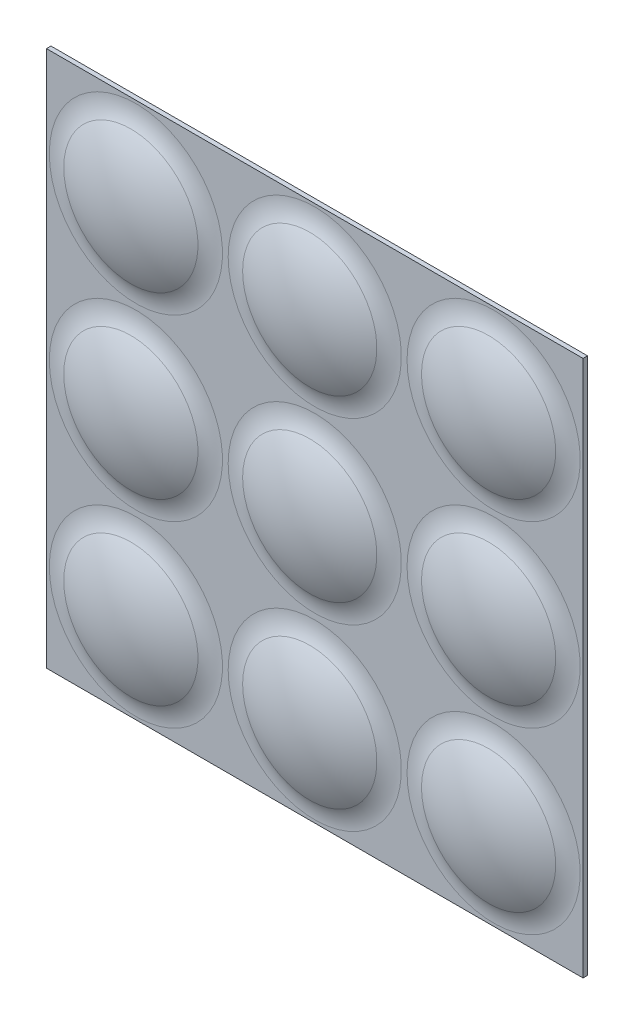
ISO-10303-21;
HEADER;
FILE_DESCRIPTION(('STEP AP214'),'2;1');
FILE_NAME('part.step','',(''),(''),'','','');
FILE_SCHEMA(('AUTOMOTIVE_DESIGN { 1 0 10303 214 1 1 1 1 }'));
ENDSEC;
DATA;
#1=APPLICATION_CONTEXT('core data for automotive mechanical design processes');
#2=APPLICATION_PROTOCOL_DEFINITION('international standard','automotive_design',2000,#1);
#3=PRODUCT_CONTEXT('',#1,'mechanical');
#4=PRODUCT('Part','Part','',(#3));
#5=PRODUCT_RELATED_PRODUCT_CATEGORY('part','',(#4));
#6=PRODUCT_DEFINITION_FORMATION('','',#4);
#7=PRODUCT_DEFINITION_CONTEXT('part definition',#1,'design');
#8=PRODUCT_DEFINITION('design','',#6,#7);
#9=PRODUCT_DEFINITION_SHAPE('','',#8);
#10=(LENGTH_UNIT() NAMED_UNIT(*) SI_UNIT(.MILLI.,.METRE.));
#11=(NAMED_UNIT(*) PLANE_ANGLE_UNIT() SI_UNIT($,.RADIAN.));
#12=(NAMED_UNIT(*) SI_UNIT($,.STERADIAN.) SOLID_ANGLE_UNIT());
#13=UNCERTAINTY_MEASURE_WITH_UNIT(LENGTH_MEASURE(1.E-05),#10,'distance_accuracy_value','');
#14=(GEOMETRIC_REPRESENTATION_CONTEXT(3) GLOBAL_UNCERTAINTY_ASSIGNED_CONTEXT((#13)) GLOBAL_UNIT_ASSIGNED_CONTEXT((#10,
#11,#12)) REPRESENTATION_CONTEXT('',''));
#15=CARTESIAN_POINT('',(0.,0.,0.));
#16=DIRECTION('',(0.,0.,1.));
#17=DIRECTION('',(1.,0.,0.));
#18=AXIS2_PLACEMENT_3D('',#15,#16,#17);
#19=CARTESIAN_POINT('',(-60.,-60.,1.));
#20=DIRECTION('',(1.,0.,0.));
#21=DIRECTION('',(0.,-1.,0.));
#22=AXIS2_PLACEMENT_3D('',#19,#20,#21);
#23=PLANE('',#22);
#24=DIRECTION('',(0.,0.,1.));
#25=VECTOR('',#24,1.);
#26=CARTESIAN_POINT('',(-60.,60.,1.));
#27=LINE('',#26,#25);
#28=CARTESIAN_POINT('',(-60.,60.,0.));
#29=VERTEX_POINT('',#28);
#30=CARTESIAN_POINT('',(-60.,60.,1.));
#31=VERTEX_POINT('',#30);
#32=EDGE_CURVE('E11',#29,#31,#27,.T.);
#33=ORIENTED_EDGE('',*,*,#32,.F.);
#34=DIRECTION('',(0.,1.,0.));
#35=VECTOR('',#34,1.);
#36=CARTESIAN_POINT('',(-60.,0.,0.));
#37=LINE('',#36,#35);
#38=CARTESIAN_POINT('',(-60.,-60.,0.));
#39=VERTEX_POINT('',#38);
#40=EDGE_CURVE('E91',#29,#39,#37,.F.);
#41=ORIENTED_EDGE('',*,*,#40,.T.);
#42=DIRECTION('',(0.,0.,1.));
#43=VECTOR('',#42,1.);
#44=CARTESIAN_POINT('',(-60.,-60.,1.));
#45=LINE('',#44,#43);
#46=CARTESIAN_POINT('',(-60.,-60.,1.));
#47=VERTEX_POINT('',#46);
#48=EDGE_CURVE('E47',#39,#47,#45,.T.);
#49=ORIENTED_EDGE('',*,*,#48,.T.);
#50=DIRECTION('',(0.,-1.,0.));
#51=VECTOR('',#50,1.);
#52=CARTESIAN_POINT('',(-60.,-60.,1.));
#53=LINE('',#52,#51);
#54=EDGE_CURVE('E108',#31,#47,#53,.T.);
#55=ORIENTED_EDGE('',*,*,#54,.F.);
#56=EDGE_LOOP('',(#33,#41,#49,#55));
#57=FACE_BOUND('',#56,.T.);
#58=ADVANCED_FACE('F37',(#57),#23,.F.);
#59=CARTESIAN_POINT('',(-60.,-60.,1.));
#60=DIRECTION('',(0.,1.,0.));
#61=DIRECTION('',(1.,0.,0.));
#62=AXIS2_PLACEMENT_3D('',#59,#60,#61);
#63=PLANE('',#62);
#64=ORIENTED_EDGE('',*,*,#48,.F.);
#65=DIRECTION('',(-1.,0.,0.));
#66=VECTOR('',#65,1.);
#67=CARTESIAN_POINT('',(0.,-60.,0.));
#68=LINE('',#67,#66);
#69=CARTESIAN_POINT('',(60.,-60.,0.));
#70=VERTEX_POINT('',#69);
#71=EDGE_CURVE('E102',#39,#70,#68,.F.);
#72=ORIENTED_EDGE('',*,*,#71,.T.);
#73=DIRECTION('',(0.,0.,1.));
#74=VECTOR('',#73,1.);
#75=CARTESIAN_POINT('',(60.,-60.,1.));
#76=LINE('',#75,#74);
#77=CARTESIAN_POINT('',(60.,-60.,1.));
#78=VERTEX_POINT('',#77);
#79=EDGE_CURVE('E55',#70,#78,#76,.T.);
#80=ORIENTED_EDGE('',*,*,#79,.T.);
#81=DIRECTION('',(1.,0.,0.));
#82=VECTOR('',#81,1.);
#83=CARTESIAN_POINT('',(-60.,-60.,1.));
#84=LINE('',#83,#82);
#85=EDGE_CURVE('E85',#47,#78,#84,.T.);
#86=ORIENTED_EDGE('',*,*,#85,.F.);
#87=EDGE_LOOP('',(#64,#72,#80,#86));
#88=FACE_BOUND('',#87,.T.);
#89=ADVANCED_FACE('F112',(#88),#63,.F.);
#90=CARTESIAN_POINT('',(60.,-60.,1.));
#91=DIRECTION('',(-1.,0.,0.));
#92=DIRECTION('',(0.,1.,0.));
#93=AXIS2_PLACEMENT_3D('',#90,#91,#92);
#94=PLANE('',#93);
#95=ORIENTED_EDGE('',*,*,#79,.F.);
#96=DIRECTION('',(0.,1.,0.));
#97=VECTOR('',#96,1.);
#98=CARTESIAN_POINT('',(60.,0.,0.));
#99=LINE('',#98,#97);
#100=CARTESIAN_POINT('',(60.,60.,0.));
#101=VERTEX_POINT('',#100);
#102=EDGE_CURVE('E90',#70,#101,#99,.T.);
#103=ORIENTED_EDGE('',*,*,#102,.T.);
#104=DIRECTION('',(0.,0.,1.));
#105=VECTOR('',#104,1.);
#106=CARTESIAN_POINT('',(60.,60.,1.));
#107=LINE('',#106,#105);
#108=CARTESIAN_POINT('',(60.,60.,1.));
#109=VERTEX_POINT('',#108);
#110=EDGE_CURVE('E41',#101,#109,#107,.T.);
#111=ORIENTED_EDGE('',*,*,#110,.T.);
#112=DIRECTION('',(0.,1.,0.));
#113=VECTOR('',#112,1.);
#114=CARTESIAN_POINT('',(60.,-60.,1.));
#115=LINE('',#114,#113);
#116=EDGE_CURVE('E104',#78,#109,#115,.T.);
#117=ORIENTED_EDGE('',*,*,#116,.F.);
#118=EDGE_LOOP('',(#95,#103,#111,#117));
#119=FACE_BOUND('',#118,.T.);
#120=ADVANCED_FACE('F93',(#119),#94,.F.);
#121=CARTESIAN_POINT('',(-60.,60.,1.));
#122=DIRECTION('',(0.,-1.,0.));
#123=DIRECTION('',(-1.,0.,0.));
#124=AXIS2_PLACEMENT_3D('',#121,#122,#123);
#125=PLANE('',#124);
#126=DIRECTION('',(-1.,0.,0.));
#127=VECTOR('',#126,1.);
#128=CARTESIAN_POINT('',(0.,60.,0.));
#129=LINE('',#128,#127);
#130=EDGE_CURVE('E79',#101,#29,#129,.T.);
#131=ORIENTED_EDGE('',*,*,#130,.T.);
#132=ORIENTED_EDGE('',*,*,#32,.T.);
#133=DIRECTION('',(-1.,0.,0.));
#134=VECTOR('',#133,1.);
#135=CARTESIAN_POINT('',(-60.,60.,1.));
#136=LINE('',#135,#134);
#137=EDGE_CURVE('E81',#109,#31,#136,.T.);
#138=ORIENTED_EDGE('',*,*,#137,.F.);
#139=ORIENTED_EDGE('',*,*,#110,.F.);
#140=EDGE_LOOP('',(#131,#132,#138,#139));
#141=FACE_BOUND('',#140,.T.);
#142=ADVANCED_FACE('F39',(#141),#125,.F.);
#143=CARTESIAN_POINT('',(0.,0.,1.));
#144=DIRECTION('',(0.,0.,-1.));
#145=DIRECTION('',(-1.,0.,0.));
#146=AXIS2_PLACEMENT_3D('',#143,#144,#145);
#147=PLANE('',#146);
#148=CARTESIAN_POINT('',(-40.,-40.,0.999999999999997));
#149=DIRECTION('',(0.,0.,-1.));
#150=DIRECTION('',(-1.,0.,0.));
#151=AXIS2_PLACEMENT_3D('',#148,#149,#150);
#152=CIRCLE('',#151,19.3649167310371);
#153=CARTESIAN_POINT('',(-59.3649167310371,-40.,0.999999999999997));
#154=VERTEX_POINT('',#153);
#155=EDGE_CURVE('E277',#154,#154,#152,.F.);
#156=ORIENTED_EDGE('',*,*,#155,.F.);
#157=EDGE_LOOP('',(#156));
#158=FACE_BOUND('',#157,.T.);
#159=CARTESIAN_POINT('',(0.,-40.,0.999999999999997));
#160=DIRECTION('',(0.,0.,-1.));
#161=DIRECTION('',(-1.,0.,0.));
#162=AXIS2_PLACEMENT_3D('',#159,#160,#161);
#163=CIRCLE('',#162,19.3649167310371);
#164=CARTESIAN_POINT('',(-19.3649167310371,-40.,0.999999999999997));
#165=VERTEX_POINT('',#164);
#166=EDGE_CURVE('E292',#165,#165,#163,.F.);
#167=ORIENTED_EDGE('',*,*,#166,.F.);
#168=EDGE_LOOP('',(#167));
#169=FACE_BOUND('',#168,.T.);
#170=CARTESIAN_POINT('',(40.,-40.,0.999999999999997));
#171=DIRECTION('',(0.,0.,-1.));
#172=DIRECTION('',(-1.,0.,0.));
#173=AXIS2_PLACEMENT_3D('',#170,#171,#172);
#174=CIRCLE('',#173,19.3649167310371);
#175=CARTESIAN_POINT('',(20.6350832689629,-40.,0.999999999999997));
#176=VERTEX_POINT('',#175);
#177=EDGE_CURVE('E304',#176,#176,#174,.F.);
#178=ORIENTED_EDGE('',*,*,#177,.F.);
#179=EDGE_LOOP('',(#178));
#180=FACE_BOUND('',#179,.T.);
#181=CARTESIAN_POINT('',(-40.,0.,0.999999999999997));
#182=DIRECTION('',(0.,0.,-1.));
#183=DIRECTION('',(-1.,0.,0.));
#184=AXIS2_PLACEMENT_3D('',#181,#182,#183);
#185=CIRCLE('',#184,19.3649167310371);
#186=CARTESIAN_POINT('',(-59.3649167310371,0.,0.999999999999997));
#187=VERTEX_POINT('',#186);
#188=EDGE_CURVE('E316',#187,#187,#185,.F.);
#189=ORIENTED_EDGE('',*,*,#188,.F.);
#190=EDGE_LOOP('',(#189));
#191=FACE_BOUND('',#190,.T.);
#192=CARTESIAN_POINT('',(0.,0.,0.999999999999997));
#193=DIRECTION('',(0.,0.,-1.));
#194=DIRECTION('',(-1.,0.,0.));
#195=AXIS2_PLACEMENT_3D('',#192,#193,#194);
#196=CIRCLE('',#195,19.3649167310371);
#197=CARTESIAN_POINT('',(-19.3649167310371,0.,0.999999999999997));
#198=VERTEX_POINT('',#197);
#199=EDGE_CURVE('E328',#198,#198,#196,.F.);
#200=ORIENTED_EDGE('',*,*,#199,.F.);
#201=EDGE_LOOP('',(#200));
#202=FACE_BOUND('',#201,.T.);
#203=CARTESIAN_POINT('',(40.,0.,0.999999999999997));
#204=DIRECTION('',(0.,0.,-1.));
#205=DIRECTION('',(-1.,0.,0.));
#206=AXIS2_PLACEMENT_3D('',#203,#204,#205);
#207=CIRCLE('',#206,19.3649167310371);
#208=CARTESIAN_POINT('',(20.6350832689629,0.,0.999999999999997));
#209=VERTEX_POINT('',#208);
#210=EDGE_CURVE('E340',#209,#209,#207,.F.);
#211=ORIENTED_EDGE('',*,*,#210,.F.);
#212=EDGE_LOOP('',(#211));
#213=FACE_BOUND('',#212,.T.);
#214=CARTESIAN_POINT('',(-40.,40.,0.999999999999997));
#215=DIRECTION('',(0.,0.,-1.));
#216=DIRECTION('',(-1.,0.,0.));
#217=AXIS2_PLACEMENT_3D('',#214,#215,#216);
#218=CIRCLE('',#217,19.3649167310371);
#219=CARTESIAN_POINT('',(-59.3649167310371,40.,0.999999999999997));
#220=VERTEX_POINT('',#219);
#221=EDGE_CURVE('E352',#220,#220,#218,.F.);
#222=ORIENTED_EDGE('',*,*,#221,.F.);
#223=EDGE_LOOP('',(#222));
#224=FACE_BOUND('',#223,.T.);
#225=CARTESIAN_POINT('',(0.,40.,0.999999999999997));
#226=DIRECTION('',(0.,0.,-1.));
#227=DIRECTION('',(-1.,0.,0.));
#228=AXIS2_PLACEMENT_3D('',#225,#226,#227);
#229=CIRCLE('',#228,19.3649167310371);
#230=CARTESIAN_POINT('',(-19.3649167310371,40.,0.999999999999997));
#231=VERTEX_POINT('',#230);
#232=EDGE_CURVE('E364',#231,#231,#229,.F.);
#233=ORIENTED_EDGE('',*,*,#232,.F.);
#234=EDGE_LOOP('',(#233));
#235=FACE_BOUND('',#234,.T.);
#236=CARTESIAN_POINT('',(40.,40.,0.999999999999997));
#237=DIRECTION('',(0.,0.,-1.));
#238=DIRECTION('',(-1.,0.,0.));
#239=AXIS2_PLACEMENT_3D('',#236,#237,#238);
#240=CIRCLE('',#239,19.3649167310371);
#241=CARTESIAN_POINT('',(20.6350832689629,40.,0.999999999999997));
#242=VERTEX_POINT('',#241);
#243=EDGE_CURVE('E374',#242,#242,#240,.F.);
#244=ORIENTED_EDGE('',*,*,#243,.F.);
#245=EDGE_LOOP('',(#244));
#246=FACE_BOUND('',#245,.T.);
#247=ORIENTED_EDGE('',*,*,#116,.T.);
#248=ORIENTED_EDGE('',*,*,#137,.T.);
#249=ORIENTED_EDGE('',*,*,#54,.T.);
#250=ORIENTED_EDGE('',*,*,#85,.T.);
#251=EDGE_LOOP('',(#247,#248,#249,#250));
#252=FACE_BOUND('',#251,.T.);
#253=ADVANCED_FACE('F111',(#158,#169,#180,#191,#202,#213,#224,#235,#246,#252),#147,.F.);
#254=CARTESIAN_POINT('',(0.,0.,0.));
#255=DIRECTION('',(0.,0.,-1.));
#256=DIRECTION('',(-1.,0.,0.));
#257=AXIS2_PLACEMENT_3D('',#254,#255,#256);
#258=PLANE('',#257);
#259=CARTESIAN_POINT('',(-40.,-40.,0.));
#260=DIRECTION('',(0.,0.,-1.));
#261=DIRECTION('',(0.,1.,0.));
#262=AXIS2_PLACEMENT_3D('',#259,#260,#261);
#263=CIRCLE('',#262,19.3649167310371);
#264=CARTESIAN_POINT('',(-40.,-20.6350832689629,0.));
#265=VERTEX_POINT('',#264);
#266=EDGE_CURVE('E276',#265,#265,#263,.F.);
#267=ORIENTED_EDGE('',*,*,#266,.T.);
#268=EDGE_LOOP('',(#267));
#269=FACE_BOUND('',#268,.T.);
#270=CARTESIAN_POINT('',(0.,-40.,0.));
#271=DIRECTION('',(0.,0.,-1.));
#272=DIRECTION('',(0.,1.,0.));
#273=AXIS2_PLACEMENT_3D('',#270,#271,#272);
#274=CIRCLE('',#273,19.3649167310371);
#275=CARTESIAN_POINT('',(0.,-20.6350832689629,0.));
#276=VERTEX_POINT('',#275);
#277=EDGE_CURVE('E291',#276,#276,#274,.F.);
#278=ORIENTED_EDGE('',*,*,#277,.T.);
#279=EDGE_LOOP('',(#278));
#280=FACE_BOUND('',#279,.T.);
#281=CARTESIAN_POINT('',(40.,-40.,0.));
#282=DIRECTION('',(0.,0.,-1.));
#283=DIRECTION('',(0.,1.,0.));
#284=AXIS2_PLACEMENT_3D('',#281,#282,#283);
#285=CIRCLE('',#284,19.3649167310371);
#286=CARTESIAN_POINT('',(40.,-20.6350832689629,0.));
#287=VERTEX_POINT('',#286);
#288=EDGE_CURVE('E303',#287,#287,#285,.F.);
#289=ORIENTED_EDGE('',*,*,#288,.T.);
#290=EDGE_LOOP('',(#289));
#291=FACE_BOUND('',#290,.T.);
#292=CARTESIAN_POINT('',(-40.,0.,0.));
#293=DIRECTION('',(0.,0.,-1.));
#294=DIRECTION('',(0.,1.,0.));
#295=AXIS2_PLACEMENT_3D('',#292,#293,#294);
#296=CIRCLE('',#295,19.3649167310371);
#297=CARTESIAN_POINT('',(-40.,19.3649167310371,0.));
#298=VERTEX_POINT('',#297);
#299=EDGE_CURVE('E315',#298,#298,#296,.F.);
#300=ORIENTED_EDGE('',*,*,#299,.T.);
#301=EDGE_LOOP('',(#300));
#302=FACE_BOUND('',#301,.T.);
#303=CARTESIAN_POINT('',(0.,0.,0.));
#304=DIRECTION('',(0.,0.,-1.));
#305=DIRECTION('',(0.,1.,0.));
#306=AXIS2_PLACEMENT_3D('',#303,#304,#305);
#307=CIRCLE('',#306,19.3649167310371);
#308=CARTESIAN_POINT('',(0.,19.3649167310371,0.));
#309=VERTEX_POINT('',#308);
#310=EDGE_CURVE('E327',#309,#309,#307,.F.);
#311=ORIENTED_EDGE('',*,*,#310,.T.);
#312=EDGE_LOOP('',(#311));
#313=FACE_BOUND('',#312,.T.);
#314=CARTESIAN_POINT('',(40.,0.,0.));
#315=DIRECTION('',(0.,0.,-1.));
#316=DIRECTION('',(0.,1.,0.));
#317=AXIS2_PLACEMENT_3D('',#314,#315,#316);
#318=CIRCLE('',#317,19.3649167310371);
#319=CARTESIAN_POINT('',(40.,19.3649167310371,0.));
#320=VERTEX_POINT('',#319);
#321=EDGE_CURVE('E339',#320,#320,#318,.F.);
#322=ORIENTED_EDGE('',*,*,#321,.T.);
#323=EDGE_LOOP('',(#322));
#324=FACE_BOUND('',#323,.T.);
#325=CARTESIAN_POINT('',(-40.,40.,0.));
#326=DIRECTION('',(0.,0.,-1.));
#327=DIRECTION('',(0.,1.,0.));
#328=AXIS2_PLACEMENT_3D('',#325,#326,#327);
#329=CIRCLE('',#328,19.3649167310371);
#330=CARTESIAN_POINT('',(-40.,59.3649167310371,0.));
#331=VERTEX_POINT('',#330);
#332=EDGE_CURVE('E351',#331,#331,#329,.F.);
#333=ORIENTED_EDGE('',*,*,#332,.T.);
#334=EDGE_LOOP('',(#333));
#335=FACE_BOUND('',#334,.T.);
#336=CARTESIAN_POINT('',(0.,40.,0.));
#337=DIRECTION('',(0.,0.,-1.));
#338=DIRECTION('',(0.,1.,0.));
#339=AXIS2_PLACEMENT_3D('',#336,#337,#338);
#340=CIRCLE('',#339,19.3649167310371);
#341=CARTESIAN_POINT('',(0.,59.3649167310371,0.));
#342=VERTEX_POINT('',#341);
#343=EDGE_CURVE('E363',#342,#342,#340,.F.);
#344=ORIENTED_EDGE('',*,*,#343,.T.);
#345=EDGE_LOOP('',(#344));
#346=FACE_BOUND('',#345,.T.);
#347=CARTESIAN_POINT('',(40.,40.,0.));
#348=DIRECTION('',(0.,0.,-1.));
#349=DIRECTION('',(0.,1.,0.));
#350=AXIS2_PLACEMENT_3D('',#347,#348,#349);
#351=CIRCLE('',#350,19.3649167310371);
#352=CARTESIAN_POINT('',(40.,59.3649167310371,0.));
#353=VERTEX_POINT('',#352);
#354=EDGE_CURVE('E94',#353,#353,#351,.F.);
#355=ORIENTED_EDGE('',*,*,#354,.T.);
#356=EDGE_LOOP('',(#355));
#357=FACE_BOUND('',#356,.T.);
#358=ORIENTED_EDGE('',*,*,#102,.F.);
#359=ORIENTED_EDGE('',*,*,#71,.F.);
#360=ORIENTED_EDGE('',*,*,#40,.F.);
#361=ORIENTED_EDGE('',*,*,#130,.F.);
#362=EDGE_LOOP('',(#358,#359,#360,#361));
#363=FACE_BOUND('',#362,.T.);
#364=ADVANCED_FACE('F88',(#269,#280,#291,#302,#313,#324,#335,#346,#357,#363),#258,.T.);
#365=CARTESIAN_POINT('',(40.,40.,10.));
#366=DIRECTION('',(0.,0.,-1.));
#367=DIRECTION('',(0.,1.,0.));
#368=AXIS2_PLACEMENT_3D('',#365,#366,#367);
#369=TOROIDAL_SURFACE('',#368,19.3649167310371,10.);
#370=ORIENTED_EDGE('',*,*,#354,.F.);
#371=EDGE_LOOP('',(#370));
#372=FACE_BOUND('',#371,.T.);
#373=CARTESIAN_POINT('',(40.,40.,1.25));
#374=DIRECTION('',(0.,0.,-1.));
#375=DIRECTION('',(0.,1.,0.));
#376=AXIS2_PLACEMENT_3D('',#373,#374,#375);
#377=CIRCLE('',#376,14.5236875482778);
#378=CARTESIAN_POINT('',(40.,54.5236875482778,1.25));
#379=VERTEX_POINT('',#378);
#380=EDGE_CURVE('E97',#379,#379,#377,.F.);
#381=ORIENTED_EDGE('',*,*,#380,.T.);
#382=EDGE_LOOP('',(#381));
#383=FACE_BOUND('',#382,.T.);
#384=ADVANCED_FACE('F123',(#372,#383),#369,.T.);
#385=CARTESIAN_POINT('',(40.,40.,-25.));
#386=DIRECTION('',(0.,0.,-1.));
#387=DIRECTION('',(-1.,0.,0.));
#388=AXIS2_PLACEMENT_3D('',#385,#386,#387);
#389=SPHERICAL_SURFACE('',#388,31.);
#390=CARTESIAN_POINT('',(40.,40.,2.125));
#391=DIRECTION('',(0.,0.,-1.));
#392=DIRECTION('',(-1.,0.,0.));
#393=AXIS2_PLACEMENT_3D('',#390,#391,#392);
#394=CIRCLE('',#393,15.0078104665537);
#395=CARTESIAN_POINT('',(24.9921895334463,40.,2.125));
#396=VERTEX_POINT('',#395);
#397=EDGE_CURVE('E371',#396,#396,#394,.F.);
#398=ORIENTED_EDGE('',*,*,#397,.T.);
#399=EDGE_LOOP('',(#398));
#400=FACE_BOUND('',#399,.T.);
#401=ADVANCED_FACE('F130',(#400),#389,.T.);
#402=CARTESIAN_POINT('',(40.,40.,10.));
#403=DIRECTION('',(0.,0.,-1.));
#404=DIRECTION('',(0.,1.,0.));
#405=AXIS2_PLACEMENT_3D('',#402,#403,#404);
#406=TOROIDAL_SURFACE('',#405,19.3649167310371,9.);
#407=ORIENTED_EDGE('',*,*,#243,.T.);
#408=EDGE_LOOP('',(#407));
#409=FACE_BOUND('',#408,.T.);
#410=ORIENTED_EDGE('',*,*,#397,.F.);
#411=EDGE_LOOP('',(#410));
#412=FACE_BOUND('',#411,.T.);
#413=ADVANCED_FACE('F134',(#409,#412),#406,.F.);
#414=CARTESIAN_POINT('',(40.,40.,-25.));
#415=DIRECTION('',(0.,0.,-1.));
#416=DIRECTION('',(-1.,0.,0.));
#417=AXIS2_PLACEMENT_3D('',#414,#415,#416);
#418=SPHERICAL_SURFACE('',#417,30.);
#419=ORIENTED_EDGE('',*,*,#380,.F.);
#420=EDGE_LOOP('',(#419));
#421=FACE_BOUND('',#420,.T.);
#422=ADVANCED_FACE('F138',(#421),#418,.F.);
#423=CARTESIAN_POINT('',(0.,40.,10.));
#424=DIRECTION('',(0.,0.,-1.));
#425=DIRECTION('',(0.,1.,0.));
#426=AXIS2_PLACEMENT_3D('',#423,#424,#425);
#427=TOROIDAL_SURFACE('',#426,19.3649167310371,10.);
#428=ORIENTED_EDGE('',*,*,#343,.F.);
#429=EDGE_LOOP('',(#428));
#430=FACE_BOUND('',#429,.T.);
#431=CARTESIAN_POINT('',(0.,40.,1.25));
#432=DIRECTION('',(0.,0.,-1.));
#433=DIRECTION('',(0.,1.,0.));
#434=AXIS2_PLACEMENT_3D('',#431,#432,#433);
#435=CIRCLE('',#434,14.5236875482778);
#436=CARTESIAN_POINT('',(0.,54.5236875482778,1.25));
#437=VERTEX_POINT('',#436);
#438=EDGE_CURVE('E360',#437,#437,#435,.F.);
#439=ORIENTED_EDGE('',*,*,#438,.T.);
#440=EDGE_LOOP('',(#439));
#441=FACE_BOUND('',#440,.T.);
#442=ADVANCED_FACE('F142',(#430,#441),#427,.T.);
#443=CARTESIAN_POINT('',(0.,40.,-25.));
#444=DIRECTION('',(0.,0.,-1.));
#445=DIRECTION('',(-1.,0.,0.));
#446=AXIS2_PLACEMENT_3D('',#443,#444,#445);
#447=SPHERICAL_SURFACE('',#446,31.);
#448=CARTESIAN_POINT('',(0.,40.,2.125));
#449=DIRECTION('',(0.,0.,-1.));
#450=DIRECTION('',(-1.,0.,0.));
#451=AXIS2_PLACEMENT_3D('',#448,#449,#450);
#452=CIRCLE('',#451,15.0078104665537);
#453=CARTESIAN_POINT('',(-15.0078104665537,40.,2.125));
#454=VERTEX_POINT('',#453);
#455=EDGE_CURVE('E359',#454,#454,#452,.F.);
#456=ORIENTED_EDGE('',*,*,#455,.T.);
#457=EDGE_LOOP('',(#456));
#458=FACE_BOUND('',#457,.T.);
#459=ADVANCED_FACE('F146',(#458),#447,.T.);
#460=CARTESIAN_POINT('',(0.,40.,10.));
#461=DIRECTION('',(0.,0.,-1.));
#462=DIRECTION('',(0.,1.,0.));
#463=AXIS2_PLACEMENT_3D('',#460,#461,#462);
#464=TOROIDAL_SURFACE('',#463,19.3649167310371,9.);
#465=ORIENTED_EDGE('',*,*,#232,.T.);
#466=EDGE_LOOP('',(#465));
#467=FACE_BOUND('',#466,.T.);
#468=ORIENTED_EDGE('',*,*,#455,.F.);
#469=EDGE_LOOP('',(#468));
#470=FACE_BOUND('',#469,.T.);
#471=ADVANCED_FACE('F150',(#467,#470),#464,.F.);
#472=CARTESIAN_POINT('',(0.,40.,-25.));
#473=DIRECTION('',(0.,0.,-1.));
#474=DIRECTION('',(-1.,0.,0.));
#475=AXIS2_PLACEMENT_3D('',#472,#473,#474);
#476=SPHERICAL_SURFACE('',#475,30.);
#477=ORIENTED_EDGE('',*,*,#438,.F.);
#478=EDGE_LOOP('',(#477));
#479=FACE_BOUND('',#478,.T.);
#480=ADVANCED_FACE('F154',(#479),#476,.F.);
#481=CARTESIAN_POINT('',(-40.,40.,10.));
#482=DIRECTION('',(0.,0.,-1.));
#483=DIRECTION('',(0.,1.,0.));
#484=AXIS2_PLACEMENT_3D('',#481,#482,#483);
#485=TOROIDAL_SURFACE('',#484,19.3649167310371,10.);
#486=ORIENTED_EDGE('',*,*,#332,.F.);
#487=EDGE_LOOP('',(#486));
#488=FACE_BOUND('',#487,.T.);
#489=CARTESIAN_POINT('',(-40.,40.,1.25));
#490=DIRECTION('',(0.,0.,-1.));
#491=DIRECTION('',(0.,1.,0.));
#492=AXIS2_PLACEMENT_3D('',#489,#490,#491);
#493=CIRCLE('',#492,14.5236875482778);
#494=CARTESIAN_POINT('',(-40.,54.5236875482778,1.25));
#495=VERTEX_POINT('',#494);
#496=EDGE_CURVE('E348',#495,#495,#493,.F.);
#497=ORIENTED_EDGE('',*,*,#496,.T.);
#498=EDGE_LOOP('',(#497));
#499=FACE_BOUND('',#498,.T.);
#500=ADVANCED_FACE('F158',(#488,#499),#485,.T.);
#501=CARTESIAN_POINT('',(-40.,40.,-25.));
#502=DIRECTION('',(0.,0.,-1.));
#503=DIRECTION('',(-1.,0.,0.));
#504=AXIS2_PLACEMENT_3D('',#501,#502,#503);
#505=SPHERICAL_SURFACE('',#504,31.);
#506=CARTESIAN_POINT('',(-40.,40.,2.125));
#507=DIRECTION('',(0.,0.,-1.));
#508=DIRECTION('',(-1.,0.,0.));
#509=AXIS2_PLACEMENT_3D('',#506,#507,#508);
#510=CIRCLE('',#509,15.0078104665537);
#511=CARTESIAN_POINT('',(-55.0078104665537,40.,2.125));
#512=VERTEX_POINT('',#511);
#513=EDGE_CURVE('E347',#512,#512,#510,.F.);
#514=ORIENTED_EDGE('',*,*,#513,.T.);
#515=EDGE_LOOP('',(#514));
#516=FACE_BOUND('',#515,.T.);
#517=ADVANCED_FACE('F162',(#516),#505,.T.);
#518=CARTESIAN_POINT('',(-40.,40.,10.));
#519=DIRECTION('',(0.,0.,-1.));
#520=DIRECTION('',(0.,1.,0.));
#521=AXIS2_PLACEMENT_3D('',#518,#519,#520);
#522=TOROIDAL_SURFACE('',#521,19.3649167310371,9.);
#523=ORIENTED_EDGE('',*,*,#221,.T.);
#524=EDGE_LOOP('',(#523));
#525=FACE_BOUND('',#524,.T.);
#526=ORIENTED_EDGE('',*,*,#513,.F.);
#527=EDGE_LOOP('',(#526));
#528=FACE_BOUND('',#527,.T.);
#529=ADVANCED_FACE('F166',(#525,#528),#522,.F.);
#530=CARTESIAN_POINT('',(-40.,40.,-25.));
#531=DIRECTION('',(0.,0.,-1.));
#532=DIRECTION('',(-1.,0.,0.));
#533=AXIS2_PLACEMENT_3D('',#530,#531,#532);
#534=SPHERICAL_SURFACE('',#533,30.);
#535=ORIENTED_EDGE('',*,*,#496,.F.);
#536=EDGE_LOOP('',(#535));
#537=FACE_BOUND('',#536,.T.);
#538=ADVANCED_FACE('F170',(#537),#534,.F.);
#539=CARTESIAN_POINT('',(40.,0.,10.));
#540=DIRECTION('',(0.,0.,-1.));
#541=DIRECTION('',(0.,1.,0.));
#542=AXIS2_PLACEMENT_3D('',#539,#540,#541);
#543=TOROIDAL_SURFACE('',#542,19.3649167310371,10.);
#544=ORIENTED_EDGE('',*,*,#321,.F.);
#545=EDGE_LOOP('',(#544));
#546=FACE_BOUND('',#545,.T.);
#547=CARTESIAN_POINT('',(40.,0.,1.25));
#548=DIRECTION('',(0.,0.,-1.));
#549=DIRECTION('',(0.,1.,0.));
#550=AXIS2_PLACEMENT_3D('',#547,#548,#549);
#551=CIRCLE('',#550,14.5236875482778);
#552=CARTESIAN_POINT('',(40.,14.5236875482778,1.25));
#553=VERTEX_POINT('',#552);
#554=EDGE_CURVE('E336',#553,#553,#551,.F.);
#555=ORIENTED_EDGE('',*,*,#554,.T.);
#556=EDGE_LOOP('',(#555));
#557=FACE_BOUND('',#556,.T.);
#558=ADVANCED_FACE('F174',(#546,#557),#543,.T.);
#559=CARTESIAN_POINT('',(40.,0.,-25.));
#560=DIRECTION('',(0.,0.,-1.));
#561=DIRECTION('',(-1.,0.,0.));
#562=AXIS2_PLACEMENT_3D('',#559,#560,#561);
#563=SPHERICAL_SURFACE('',#562,31.);
#564=CARTESIAN_POINT('',(40.,0.,2.125));
#565=DIRECTION('',(0.,0.,-1.));
#566=DIRECTION('',(-1.,0.,0.));
#567=AXIS2_PLACEMENT_3D('',#564,#565,#566);
#568=CIRCLE('',#567,15.0078104665537);
#569=CARTESIAN_POINT('',(24.9921895334463,0.,2.125));
#570=VERTEX_POINT('',#569);
#571=EDGE_CURVE('E335',#570,#570,#568,.F.);
#572=ORIENTED_EDGE('',*,*,#571,.T.);
#573=EDGE_LOOP('',(#572));
#574=FACE_BOUND('',#573,.T.);
#575=ADVANCED_FACE('F178',(#574),#563,.T.);
#576=CARTESIAN_POINT('',(40.,0.,10.));
#577=DIRECTION('',(0.,0.,-1.));
#578=DIRECTION('',(0.,1.,0.));
#579=AXIS2_PLACEMENT_3D('',#576,#577,#578);
#580=TOROIDAL_SURFACE('',#579,19.3649167310371,9.);
#581=ORIENTED_EDGE('',*,*,#210,.T.);
#582=EDGE_LOOP('',(#581));
#583=FACE_BOUND('',#582,.T.);
#584=ORIENTED_EDGE('',*,*,#571,.F.);
#585=EDGE_LOOP('',(#584));
#586=FACE_BOUND('',#585,.T.);
#587=ADVANCED_FACE('F182',(#583,#586),#580,.F.);
#588=CARTESIAN_POINT('',(40.,0.,-25.));
#589=DIRECTION('',(0.,0.,-1.));
#590=DIRECTION('',(-1.,0.,0.));
#591=AXIS2_PLACEMENT_3D('',#588,#589,#590);
#592=SPHERICAL_SURFACE('',#591,30.);
#593=ORIENTED_EDGE('',*,*,#554,.F.);
#594=EDGE_LOOP('',(#593));
#595=FACE_BOUND('',#594,.T.);
#596=ADVANCED_FACE('F186',(#595),#592,.F.);
#597=CARTESIAN_POINT('',(0.,0.,10.));
#598=DIRECTION('',(0.,0.,-1.));
#599=DIRECTION('',(0.,1.,0.));
#600=AXIS2_PLACEMENT_3D('',#597,#598,#599);
#601=TOROIDAL_SURFACE('',#600,19.3649167310371,10.);
#602=ORIENTED_EDGE('',*,*,#310,.F.);
#603=EDGE_LOOP('',(#602));
#604=FACE_BOUND('',#603,.T.);
#605=CARTESIAN_POINT('',(0.,0.,1.25));
#606=DIRECTION('',(0.,0.,-1.));
#607=DIRECTION('',(0.,1.,0.));
#608=AXIS2_PLACEMENT_3D('',#605,#606,#607);
#609=CIRCLE('',#608,14.5236875482778);
#610=CARTESIAN_POINT('',(0.,14.5236875482778,1.25));
#611=VERTEX_POINT('',#610);
#612=EDGE_CURVE('E324',#611,#611,#609,.F.);
#613=ORIENTED_EDGE('',*,*,#612,.T.);
#614=EDGE_LOOP('',(#613));
#615=FACE_BOUND('',#614,.T.);
#616=ADVANCED_FACE('F190',(#604,#615),#601,.T.);
#617=CARTESIAN_POINT('',(0.,0.,-25.));
#618=DIRECTION('',(0.,0.,-1.));
#619=DIRECTION('',(-1.,0.,0.));
#620=AXIS2_PLACEMENT_3D('',#617,#618,#619);
#621=SPHERICAL_SURFACE('',#620,31.);
#622=CARTESIAN_POINT('',(0.,0.,2.125));
#623=DIRECTION('',(0.,0.,-1.));
#624=DIRECTION('',(-1.,0.,0.));
#625=AXIS2_PLACEMENT_3D('',#622,#623,#624);
#626=CIRCLE('',#625,15.0078104665537);
#627=CARTESIAN_POINT('',(-15.0078104665537,0.,2.125));
#628=VERTEX_POINT('',#627);
#629=EDGE_CURVE('E323',#628,#628,#626,.F.);
#630=ORIENTED_EDGE('',*,*,#629,.T.);
#631=EDGE_LOOP('',(#630));
#632=FACE_BOUND('',#631,.T.);
#633=ADVANCED_FACE('F194',(#632),#621,.T.);
#634=CARTESIAN_POINT('',(0.,0.,10.));
#635=DIRECTION('',(0.,0.,-1.));
#636=DIRECTION('',(0.,1.,0.));
#637=AXIS2_PLACEMENT_3D('',#634,#635,#636);
#638=TOROIDAL_SURFACE('',#637,19.3649167310371,9.);
#639=ORIENTED_EDGE('',*,*,#199,.T.);
#640=EDGE_LOOP('',(#639));
#641=FACE_BOUND('',#640,.T.);
#642=ORIENTED_EDGE('',*,*,#629,.F.);
#643=EDGE_LOOP('',(#642));
#644=FACE_BOUND('',#643,.T.);
#645=ADVANCED_FACE('F198',(#641,#644),#638,.F.);
#646=CARTESIAN_POINT('',(0.,0.,-25.));
#647=DIRECTION('',(0.,0.,-1.));
#648=DIRECTION('',(-1.,0.,0.));
#649=AXIS2_PLACEMENT_3D('',#646,#647,#648);
#650=SPHERICAL_SURFACE('',#649,30.);
#651=ORIENTED_EDGE('',*,*,#612,.F.);
#652=EDGE_LOOP('',(#651));
#653=FACE_BOUND('',#652,.T.);
#654=ADVANCED_FACE('F202',(#653),#650,.F.);
#655=CARTESIAN_POINT('',(-40.,0.,10.));
#656=DIRECTION('',(0.,0.,-1.));
#657=DIRECTION('',(0.,1.,0.));
#658=AXIS2_PLACEMENT_3D('',#655,#656,#657);
#659=TOROIDAL_SURFACE('',#658,19.3649167310371,10.);
#660=ORIENTED_EDGE('',*,*,#299,.F.);
#661=EDGE_LOOP('',(#660));
#662=FACE_BOUND('',#661,.T.);
#663=CARTESIAN_POINT('',(-40.,0.,1.25));
#664=DIRECTION('',(0.,0.,-1.));
#665=DIRECTION('',(0.,1.,0.));
#666=AXIS2_PLACEMENT_3D('',#663,#664,#665);
#667=CIRCLE('',#666,14.5236875482778);
#668=CARTESIAN_POINT('',(-40.,14.5236875482778,1.25));
#669=VERTEX_POINT('',#668);
#670=EDGE_CURVE('E312',#669,#669,#667,.F.);
#671=ORIENTED_EDGE('',*,*,#670,.T.);
#672=EDGE_LOOP('',(#671));
#673=FACE_BOUND('',#672,.T.);
#674=ADVANCED_FACE('F206',(#662,#673),#659,.T.);
#675=CARTESIAN_POINT('',(-40.,0.,-25.));
#676=DIRECTION('',(0.,0.,-1.));
#677=DIRECTION('',(-1.,0.,0.));
#678=AXIS2_PLACEMENT_3D('',#675,#676,#677);
#679=SPHERICAL_SURFACE('',#678,31.);
#680=CARTESIAN_POINT('',(-40.,0.,2.125));
#681=DIRECTION('',(0.,0.,-1.));
#682=DIRECTION('',(-1.,0.,0.));
#683=AXIS2_PLACEMENT_3D('',#680,#681,#682);
#684=CIRCLE('',#683,15.0078104665537);
#685=CARTESIAN_POINT('',(-55.0078104665537,0.,2.125));
#686=VERTEX_POINT('',#685);
#687=EDGE_CURVE('E311',#686,#686,#684,.F.);
#688=ORIENTED_EDGE('',*,*,#687,.T.);
#689=EDGE_LOOP('',(#688));
#690=FACE_BOUND('',#689,.T.);
#691=ADVANCED_FACE('F210',(#690),#679,.T.);
#692=CARTESIAN_POINT('',(-40.,0.,10.));
#693=DIRECTION('',(0.,0.,-1.));
#694=DIRECTION('',(0.,1.,0.));
#695=AXIS2_PLACEMENT_3D('',#692,#693,#694);
#696=TOROIDAL_SURFACE('',#695,19.3649167310371,9.);
#697=ORIENTED_EDGE('',*,*,#188,.T.);
#698=EDGE_LOOP('',(#697));
#699=FACE_BOUND('',#698,.T.);
#700=ORIENTED_EDGE('',*,*,#687,.F.);
#701=EDGE_LOOP('',(#700));
#702=FACE_BOUND('',#701,.T.);
#703=ADVANCED_FACE('F214',(#699,#702),#696,.F.);
#704=CARTESIAN_POINT('',(-40.,0.,-25.));
#705=DIRECTION('',(0.,0.,-1.));
#706=DIRECTION('',(-1.,0.,0.));
#707=AXIS2_PLACEMENT_3D('',#704,#705,#706);
#708=SPHERICAL_SURFACE('',#707,30.);
#709=ORIENTED_EDGE('',*,*,#670,.F.);
#710=EDGE_LOOP('',(#709));
#711=FACE_BOUND('',#710,.T.);
#712=ADVANCED_FACE('F218',(#711),#708,.F.);
#713=CARTESIAN_POINT('',(40.,-40.,10.));
#714=DIRECTION('',(0.,0.,-1.));
#715=DIRECTION('',(0.,1.,0.));
#716=AXIS2_PLACEMENT_3D('',#713,#714,#715);
#717=TOROIDAL_SURFACE('',#716,19.3649167310371,10.);
#718=ORIENTED_EDGE('',*,*,#288,.F.);
#719=EDGE_LOOP('',(#718));
#720=FACE_BOUND('',#719,.T.);
#721=CARTESIAN_POINT('',(40.,-40.,1.25));
#722=DIRECTION('',(0.,0.,-1.));
#723=DIRECTION('',(0.,1.,0.));
#724=AXIS2_PLACEMENT_3D('',#721,#722,#723);
#725=CIRCLE('',#724,14.5236875482778);
#726=CARTESIAN_POINT('',(40.,-25.4763124517222,1.25));
#727=VERTEX_POINT('',#726);
#728=EDGE_CURVE('E300',#727,#727,#725,.F.);
#729=ORIENTED_EDGE('',*,*,#728,.T.);
#730=EDGE_LOOP('',(#729));
#731=FACE_BOUND('',#730,.T.);
#732=ADVANCED_FACE('F222',(#720,#731),#717,.T.);
#733=CARTESIAN_POINT('',(40.,-40.,-25.));
#734=DIRECTION('',(0.,0.,-1.));
#735=DIRECTION('',(-1.,0.,0.));
#736=AXIS2_PLACEMENT_3D('',#733,#734,#735);
#737=SPHERICAL_SURFACE('',#736,31.);
#738=CARTESIAN_POINT('',(40.,-40.,2.125));
#739=DIRECTION('',(0.,0.,-1.));
#740=DIRECTION('',(-1.,0.,0.));
#741=AXIS2_PLACEMENT_3D('',#738,#739,#740);
#742=CIRCLE('',#741,15.0078104665537);
#743=CARTESIAN_POINT('',(24.9921895334462,-40.,2.125));
#744=VERTEX_POINT('',#743);
#745=EDGE_CURVE('E299',#744,#744,#742,.F.);
#746=ORIENTED_EDGE('',*,*,#745,.T.);
#747=EDGE_LOOP('',(#746));
#748=FACE_BOUND('',#747,.T.);
#749=ADVANCED_FACE('F226',(#748),#737,.T.);
#750=CARTESIAN_POINT('',(40.,-40.,10.));
#751=DIRECTION('',(0.,0.,-1.));
#752=DIRECTION('',(0.,1.,0.));
#753=AXIS2_PLACEMENT_3D('',#750,#751,#752);
#754=TOROIDAL_SURFACE('',#753,19.3649167310371,9.);
#755=ORIENTED_EDGE('',*,*,#177,.T.);
#756=EDGE_LOOP('',(#755));
#757=FACE_BOUND('',#756,.T.);
#758=ORIENTED_EDGE('',*,*,#745,.F.);
#759=EDGE_LOOP('',(#758));
#760=FACE_BOUND('',#759,.T.);
#761=ADVANCED_FACE('F230',(#757,#760),#754,.F.);
#762=CARTESIAN_POINT('',(40.,-40.,-25.));
#763=DIRECTION('',(0.,0.,-1.));
#764=DIRECTION('',(-1.,0.,0.));
#765=AXIS2_PLACEMENT_3D('',#762,#763,#764);
#766=SPHERICAL_SURFACE('',#765,30.);
#767=ORIENTED_EDGE('',*,*,#728,.F.);
#768=EDGE_LOOP('',(#767));
#769=FACE_BOUND('',#768,.T.);
#770=ADVANCED_FACE('F234',(#769),#766,.F.);
#771=CARTESIAN_POINT('',(0.,-40.,10.));
#772=DIRECTION('',(0.,0.,-1.));
#773=DIRECTION('',(0.,1.,0.));
#774=AXIS2_PLACEMENT_3D('',#771,#772,#773);
#775=TOROIDAL_SURFACE('',#774,19.3649167310371,10.);
#776=ORIENTED_EDGE('',*,*,#277,.F.);
#777=EDGE_LOOP('',(#776));
#778=FACE_BOUND('',#777,.T.);
#779=CARTESIAN_POINT('',(0.,-40.,1.25));
#780=DIRECTION('',(0.,0.,-1.));
#781=DIRECTION('',(0.,1.,0.));
#782=AXIS2_PLACEMENT_3D('',#779,#780,#781);
#783=CIRCLE('',#782,14.5236875482778);
#784=CARTESIAN_POINT('',(0.,-25.4763124517222,1.25));
#785=VERTEX_POINT('',#784);
#786=EDGE_CURVE('E288',#785,#785,#783,.F.);
#787=ORIENTED_EDGE('',*,*,#786,.T.);
#788=EDGE_LOOP('',(#787));
#789=FACE_BOUND('',#788,.T.);
#790=ADVANCED_FACE('F238',(#778,#789),#775,.T.);
#791=CARTESIAN_POINT('',(0.,-40.,-25.));
#792=DIRECTION('',(0.,0.,-1.));
#793=DIRECTION('',(-1.,0.,0.));
#794=AXIS2_PLACEMENT_3D('',#791,#792,#793);
#795=SPHERICAL_SURFACE('',#794,31.);
#796=CARTESIAN_POINT('',(0.,-40.,2.125));
#797=DIRECTION('',(0.,0.,-1.));
#798=DIRECTION('',(-1.,0.,0.));
#799=AXIS2_PLACEMENT_3D('',#796,#797,#798);
#800=CIRCLE('',#799,15.0078104665537);
#801=CARTESIAN_POINT('',(-15.0078104665538,-40.,2.125));
#802=VERTEX_POINT('',#801);
#803=EDGE_CURVE('E280',#802,#802,#800,.F.);
#804=ORIENTED_EDGE('',*,*,#803,.T.);
#805=EDGE_LOOP('',(#804));
#806=FACE_BOUND('',#805,.T.);
#807=ADVANCED_FACE('F242',(#806),#795,.T.);
#808=CARTESIAN_POINT('',(0.,-40.,10.));
#809=DIRECTION('',(0.,0.,-1.));
#810=DIRECTION('',(0.,1.,0.));
#811=AXIS2_PLACEMENT_3D('',#808,#809,#810);
#812=TOROIDAL_SURFACE('',#811,19.3649167310371,9.);
#813=ORIENTED_EDGE('',*,*,#166,.T.);
#814=EDGE_LOOP('',(#813));
#815=FACE_BOUND('',#814,.T.);
#816=ORIENTED_EDGE('',*,*,#803,.F.);
#817=EDGE_LOOP('',(#816));
#818=FACE_BOUND('',#817,.T.);
#819=ADVANCED_FACE('F246',(#815,#818),#812,.F.);
#820=CARTESIAN_POINT('',(0.,-40.,-25.));
#821=DIRECTION('',(0.,0.,-1.));
#822=DIRECTION('',(-1.,0.,0.));
#823=AXIS2_PLACEMENT_3D('',#820,#821,#822);
#824=SPHERICAL_SURFACE('',#823,30.);
#825=ORIENTED_EDGE('',*,*,#786,.F.);
#826=EDGE_LOOP('',(#825));
#827=FACE_BOUND('',#826,.T.);
#828=ADVANCED_FACE('F250',(#827),#824,.F.);
#829=CARTESIAN_POINT('',(-40.,-40.,10.));
#830=DIRECTION('',(0.,0.,-1.));
#831=DIRECTION('',(0.,1.,0.));
#832=AXIS2_PLACEMENT_3D('',#829,#830,#831);
#833=TOROIDAL_SURFACE('',#832,19.3649167310371,10.);
#834=ORIENTED_EDGE('',*,*,#266,.F.);
#835=EDGE_LOOP('',(#834));
#836=FACE_BOUND('',#835,.T.);
#837=CARTESIAN_POINT('',(-40.,-40.,1.25));
#838=DIRECTION('',(0.,0.,-1.));
#839=DIRECTION('',(0.,1.,0.));
#840=AXIS2_PLACEMENT_3D('',#837,#838,#839);
#841=CIRCLE('',#840,14.5236875482778);
#842=CARTESIAN_POINT('',(-40.,-25.4763124517222,1.25));
#843=VERTEX_POINT('',#842);
#844=EDGE_CURVE('E274',#843,#843,#841,.F.);
#845=ORIENTED_EDGE('',*,*,#844,.T.);
#846=EDGE_LOOP('',(#845));
#847=FACE_BOUND('',#846,.T.);
#848=ADVANCED_FACE('F254',(#836,#847),#833,.T.);
#849=CARTESIAN_POINT('',(-40.,-40.,-25.));
#850=DIRECTION('',(0.,0.,-1.));
#851=DIRECTION('',(-1.,0.,0.));
#852=AXIS2_PLACEMENT_3D('',#849,#850,#851);
#853=SPHERICAL_SURFACE('',#852,31.);
#854=CARTESIAN_POINT('',(-40.,-40.,2.125));
#855=DIRECTION('',(0.,0.,-1.));
#856=DIRECTION('',(-1.,0.,0.));
#857=AXIS2_PLACEMENT_3D('',#854,#855,#856);
#858=CIRCLE('',#857,15.0078104665537);
#859=CARTESIAN_POINT('',(-55.0078104665537,-40.,2.125));
#860=VERTEX_POINT('',#859);
#861=EDGE_CURVE('E283',#860,#860,#858,.F.);
#862=ORIENTED_EDGE('',*,*,#861,.T.);
#863=EDGE_LOOP('',(#862));
#864=FACE_BOUND('',#863,.T.);
#865=ADVANCED_FACE('F258',(#864),#853,.T.);
#866=CARTESIAN_POINT('',(-40.,-40.,10.));
#867=DIRECTION('',(0.,0.,-1.));
#868=DIRECTION('',(0.,1.,0.));
#869=AXIS2_PLACEMENT_3D('',#866,#867,#868);
#870=TOROIDAL_SURFACE('',#869,19.3649167310371,9.);
#871=ORIENTED_EDGE('',*,*,#155,.T.);
#872=EDGE_LOOP('',(#871));
#873=FACE_BOUND('',#872,.T.);
#874=ORIENTED_EDGE('',*,*,#861,.F.);
#875=EDGE_LOOP('',(#874));
#876=FACE_BOUND('',#875,.T.);
#877=ADVANCED_FACE('F262',(#873,#876),#870,.F.);
#878=CARTESIAN_POINT('',(-40.,-40.,-25.));
#879=DIRECTION('',(0.,0.,-1.));
#880=DIRECTION('',(-1.,0.,0.));
#881=AXIS2_PLACEMENT_3D('',#878,#879,#880);
#882=SPHERICAL_SURFACE('',#881,30.);
#883=ORIENTED_EDGE('',*,*,#844,.F.);
#884=EDGE_LOOP('',(#883));
#885=FACE_BOUND('',#884,.T.);
#886=ADVANCED_FACE('F266',(#885),#882,.F.);
#887=CLOSED_SHELL('',(#58,#89,#120,#142,#253,#364,#384,#401,#413,#422,#442,#459,#471,#480,#500,
#517,#529,#538,#558,#575,#587,#596,#616,#633,#645,#654,#674,#691,#703,#712,#732,#749,#761,#770,
#790,#807,#819,#828,#848,#865,#877,#886));
#888=MANIFOLD_SOLID_BREP('B2',#887);
#889=ADVANCED_BREP_SHAPE_REPRESENTATION('',(#18,#888),#14);
#890=SHAPE_DEFINITION_REPRESENTATION(#9,#889);
ENDSEC;
END-ISO-10303-21;
